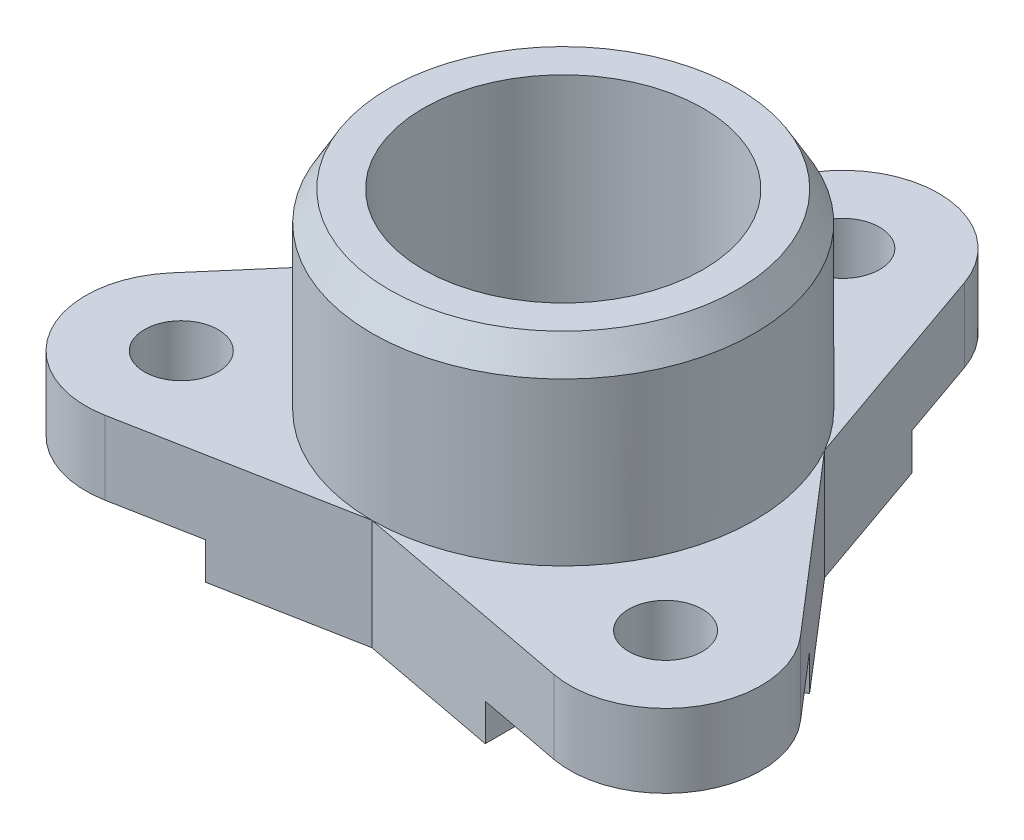
ISO-10303-21;
HEADER;
FILE_DESCRIPTION(('STEP AP214'),'2;1');
FILE_NAME('part.step','',(''),(''),'','','');
FILE_SCHEMA(('AUTOMOTIVE_DESIGN { 1 0 10303 214 1 1 1 1 }'));
ENDSEC;
DATA;
#1=APPLICATION_CONTEXT('core data for automotive mechanical design processes');
#2=APPLICATION_PROTOCOL_DEFINITION('international standard','automotive_design',2000,#1);
#3=PRODUCT_CONTEXT('',#1,'mechanical');
#4=PRODUCT('Part','Part','',(#3));
#5=PRODUCT_RELATED_PRODUCT_CATEGORY('part','',(#4));
#6=PRODUCT_DEFINITION_FORMATION('','',#4);
#7=PRODUCT_DEFINITION_CONTEXT('part definition',#1,'design');
#8=PRODUCT_DEFINITION('design','',#6,#7);
#9=PRODUCT_DEFINITION_SHAPE('','',#8);
#10=(LENGTH_UNIT() NAMED_UNIT(*) SI_UNIT(.MILLI.,.METRE.));
#11=(NAMED_UNIT(*) PLANE_ANGLE_UNIT() SI_UNIT($,.RADIAN.));
#12=(NAMED_UNIT(*) SI_UNIT($,.STERADIAN.) SOLID_ANGLE_UNIT());
#13=UNCERTAINTY_MEASURE_WITH_UNIT(LENGTH_MEASURE(1.E-05),#10,'distance_accuracy_value','');
#14=(GEOMETRIC_REPRESENTATION_CONTEXT(3) GLOBAL_UNCERTAINTY_ASSIGNED_CONTEXT((#13)) GLOBAL_UNIT_ASSIGNED_CONTEXT((#10,
#11,#12)) REPRESENTATION_CONTEXT('',''));
#15=CARTESIAN_POINT('',(0.,0.,0.));
#16=DIRECTION('',(0.,0.,1.));
#17=DIRECTION('',(1.,0.,0.));
#18=AXIS2_PLACEMENT_3D('',#15,#16,#17);
#19=CARTESIAN_POINT('',(0.,0.,0.));
#20=DIRECTION('',(0.,1.,0.));
#21=DIRECTION('',(0.,0.,1.));
#22=AXIS2_PLACEMENT_3D('',#19,#20,#21);
#23=PLANE('',#22);
#24=CARTESIAN_POINT('',(-8.22724133595217,0.,4.75));
#25=DIRECTION('',(0.,1.,0.));
#26=DIRECTION('',(0.,0.,1.));
#27=AXIS2_PLACEMENT_3D('',#24,#25,#26);
#28=CIRCLE('',#27,1.25);
#29=CARTESIAN_POINT('',(-8.22724133595217,0.,6.));
#30=VERTEX_POINT('',#29);
#31=EDGE_CURVE('E331',#30,#30,#28,.T.);
#32=ORIENTED_EDGE('',*,*,#31,.T.);
#33=EDGE_LOOP('',(#32));
#34=FACE_BOUND('',#33,.T.);
#35=CARTESIAN_POINT('',(0.,0.,-9.5));
#36=DIRECTION('',(0.,1.,0.));
#37=DIRECTION('',(0.,0.,1.));
#38=AXIS2_PLACEMENT_3D('',#35,#36,#37);
#39=CIRCLE('',#38,1.25);
#40=CARTESIAN_POINT('',(0.,0.,-8.25));
#41=VERTEX_POINT('',#40);
#42=EDGE_CURVE('E357',#41,#41,#39,.T.);
#43=ORIENTED_EDGE('',*,*,#42,.T.);
#44=EDGE_LOOP('',(#43));
#45=FACE_BOUND('',#44,.T.);
#46=CARTESIAN_POINT('',(0.,0.,0.));
#47=DIRECTION('',(0.,1.,0.));
#48=DIRECTION('',(0.,0.,1.));
#49=AXIS2_PLACEMENT_3D('',#46,#47,#48);
#50=CIRCLE('',#49,4.75);
#51=CARTESIAN_POINT('',(0.,0.,4.75));
#52=VERTEX_POINT('',#51);
#53=EDGE_CURVE('E302',#52,#52,#50,.T.);
#54=ORIENTED_EDGE('',*,*,#53,.T.);
#55=EDGE_LOOP('',(#54));
#56=FACE_BOUND('',#55,.T.);
#57=CARTESIAN_POINT('',(8.22724133595217,0.,4.75));
#58=DIRECTION('',(0.,1.,0.));
#59=DIRECTION('',(0.,0.,1.));
#60=AXIS2_PLACEMENT_3D('',#57,#58,#59);
#61=CIRCLE('',#60,1.25);
#62=CARTESIAN_POINT('',(8.22724133595217,0.,6.));
#63=VERTEX_POINT('',#62);
#64=EDGE_CURVE('E334',#63,#63,#61,.T.);
#65=ORIENTED_EDGE('',*,*,#64,.T.);
#66=EDGE_LOOP('',(#65));
#67=FACE_BOUND('',#66,.T.);
#68=DIRECTION('',(-0.499999999999992,0.,0.866025403784443));
#69=VECTOR('',#68,1.);
#70=CARTESIAN_POINT('',(-4.97964607176055,0.,-2.87499999999995));
#71=LINE('',#70,#69);
#72=CARTESIAN_POINT('',(-2.60464607176059,0.,-6.98862066797606));
#73=VERTEX_POINT('',#72);
#74=CARTESIAN_POINT('',(-7.35464607176051,0.,1.23862066797615));
#75=VERTEX_POINT('',#74);
#76=EDGE_CURVE('E213',#73,#75,#71,.T.);
#77=ORIENTED_EDGE('',*,*,#76,.F.);
#78=DIRECTION('',(-0.866025403784443,0.,-0.499999999999992));
#79=VECTOR('',#78,1.);
#80=CARTESIAN_POINT('',(2.37499999999996,0.,-4.1136206679761));
#81=LINE('',#80,#79);
#82=CARTESIAN_POINT('',(-4.03303634923954,0.,-7.81330217918636));
#83=VERTEX_POINT('',#82);
#84=EDGE_CURVE('E210',#73,#83,#81,.T.);
#85=ORIENTED_EDGE('',*,*,#84,.T.);
#86=DIRECTION('',(-0.330161167685148,0.,0.943924575033821));
#87=VECTOR('',#86,1.);
#88=CARTESIAN_POINT('',(-6.02840364790872,0.,-2.10858456312533));
#89=LINE('',#88,#87);
#90=CARTESIAN_POINT('',(-3.06775486885992,0.,-10.5730237949767));
#91=VERTEX_POINT('',#90);
#92=EDGE_CURVE('E348',#91,#83,#89,.T.);
#93=ORIENTED_EDGE('',*,*,#92,.F.);
#94=CARTESIAN_POINT('',(0.,0.,-9.5));
#95=DIRECTION('',(0.,1.,0.));
#96=DIRECTION('',(0.,0.,1.));
#97=AXIS2_PLACEMENT_3D('',#94,#95,#96);
#98=CIRCLE('',#97,3.25);
#99=CARTESIAN_POINT('',(3.06775486885992,0.,-10.5730237949767));
#100=VERTEX_POINT('',#99);
#101=EDGE_CURVE('E346',#100,#91,#98,.T.);
#102=ORIENTED_EDGE('',*,*,#101,.F.);
#103=DIRECTION('',(0.330161167685148,0.,0.943924575033821));
#104=VECTOR('',#103,1.);
#105=CARTESIAN_POINT('',(6.02840364790872,0.,-2.10858456312532));
#106=LINE('',#105,#104);
#107=CARTESIAN_POINT('',(4.03303634923946,0.,-7.81330217918642));
#108=VERTEX_POINT('',#107);
#109=EDGE_CURVE('E344',#100,#108,#106,.T.);
#110=ORIENTED_EDGE('',*,*,#109,.T.);
#111=DIRECTION('',(0.866025403784436,0.,-0.500000000000004));
#112=VECTOR('',#111,1.);
#113=CARTESIAN_POINT('',(-2.37500000000002,0.,-4.11362066797607));
#114=LINE('',#113,#112);
#115=CARTESIAN_POINT('',(2.60464607176049,0.,-6.9886206679761));
#116=VERTEX_POINT('',#115);
#117=EDGE_CURVE('E225',#116,#108,#114,.T.);
#118=ORIENTED_EDGE('',*,*,#117,.F.);
#119=DIRECTION('',(-0.500000000000004,0.,-0.866025403784436));
#120=VECTOR('',#119,1.);
#121=CARTESIAN_POINT('',(4.97964607176051,0.,-2.87500000000002));
#122=LINE('',#121,#120);
#123=CARTESIAN_POINT('',(7.35464607176053,0.,1.23862066797605));
#124=VERTEX_POINT('',#123);
#125=EDGE_CURVE('E63',#124,#116,#122,.T.);
#126=ORIENTED_EDGE('',*,*,#125,.F.);
#127=DIRECTION('',(0.866025403784436,0.,-0.500000000000004));
#128=VECTOR('',#127,1.);
#129=CARTESIAN_POINT('',(2.37500000000002,0.,4.11362066797607));
#130=LINE('',#129,#128);
#131=CARTESIAN_POINT('',(8.78303634923947,0.,0.413939156765781));
#132=VERTEX_POINT('',#131);
#133=EDGE_CURVE('E235',#124,#132,#130,.T.);
#134=ORIENTED_EDGE('',*,*,#133,.T.);
#135=DIRECTION('',(0.652382077393145,0.,0.757890246075383));
#136=VECTOR('',#135,1.);
#137=CARTESIAN_POINT('',(4.8402896216486,0.,-4.16645842179307));
#138=LINE('',#137,#136);
#139=CARTESIAN_POINT('',(10.6903846356972,0.,2.62975824847228));
#140=VERTEX_POINT('',#139);
#141=EDGE_CURVE('E342',#132,#140,#138,.T.);
#142=ORIENTED_EDGE('',*,*,#141,.T.);
#143=CARTESIAN_POINT('',(8.22724133595217,0.,4.75));
#144=DIRECTION('',(0.,1.,0.));
#145=DIRECTION('',(0.,0.,1.));
#146=AXIS2_PLACEMENT_3D('',#143,#144,#145);
#147=CIRCLE('',#146,3.25);
#148=CARTESIAN_POINT('',(7.62262976683724,0.,7.94326554650445));
#149=VERTEX_POINT('',#148);
#150=EDGE_CURVE('E339',#149,#140,#147,.T.);
#151=ORIENTED_EDGE('',*,*,#150,.F.);
#152=DIRECTION('',(0.982543245078293,0.,0.186034328958438));
#153=VECTOR('',#152,1.);
#154=CARTESIAN_POINT('',(-1.18811402626011,0.,6.27504298491839));
#155=LINE('',#154,#153);
#156=CARTESIAN_POINT('',(4.75,0.,7.39936302242063));
#157=VERTEX_POINT('',#156);
#158=EDGE_CURVE('E337',#157,#149,#155,.T.);
#159=ORIENTED_EDGE('',*,*,#158,.F.);
#160=DIRECTION('',(0.,0.,1.));
#161=VECTOR('',#160,1.);
#162=CARTESIAN_POINT('',(4.75,0.,0.));
#163=LINE('',#162,#161);
#164=CARTESIAN_POINT('',(4.75,0.,5.75));
#165=VERTEX_POINT('',#164);
#166=EDGE_CURVE('E253',#165,#157,#163,.T.);
#167=ORIENTED_EDGE('',*,*,#166,.F.);
#168=DIRECTION('',(1.,0.,0.));
#169=VECTOR('',#168,1.);
#170=CARTESIAN_POINT('',(0.,0.,5.75));
#171=LINE('',#170,#169);
#172=CARTESIAN_POINT('',(-4.75,0.,5.75));
#173=VERTEX_POINT('',#172);
#174=EDGE_CURVE('E278',#173,#165,#171,.T.);
#175=ORIENTED_EDGE('',*,*,#174,.F.);
#176=DIRECTION('',(0.,0.,1.));
#177=VECTOR('',#176,1.);
#178=CARTESIAN_POINT('',(-4.75,0.,0.));
#179=LINE('',#178,#177);
#180=CARTESIAN_POINT('',(-4.75,0.,7.39936302242063));
#181=VERTEX_POINT('',#180);
#182=EDGE_CURVE('E265',#173,#181,#179,.T.);
#183=ORIENTED_EDGE('',*,*,#182,.T.);
#184=DIRECTION('',(0.982543245078294,0.,-0.186034328958438));
#185=VECTOR('',#184,1.);
#186=CARTESIAN_POINT('',(1.18811402626011,0.,6.2750429849184));
#187=LINE('',#186,#185);
#188=CARTESIAN_POINT('',(-7.62262976683724,0.,7.94326554650445));
#189=VERTEX_POINT('',#188);
#190=EDGE_CURVE('E354',#189,#181,#187,.T.);
#191=ORIENTED_EDGE('',*,*,#190,.F.);
#192=CARTESIAN_POINT('',(-8.22724133595217,0.,4.75));
#193=DIRECTION('',(0.,1.,0.));
#194=DIRECTION('',(0.,0.,1.));
#195=AXIS2_PLACEMENT_3D('',#192,#193,#194);
#196=CIRCLE('',#195,3.25);
#197=CARTESIAN_POINT('',(-10.6903846356972,0.,2.62975824847228));
#198=VERTEX_POINT('',#197);
#199=EDGE_CURVE('E352',#198,#189,#196,.T.);
#200=ORIENTED_EDGE('',*,*,#199,.F.);
#201=DIRECTION('',(-0.652382077393145,0.,0.757890246075383));
#202=VECTOR('',#201,1.);
#203=CARTESIAN_POINT('',(-4.8402896216486,0.,-4.16645842179307));
#204=LINE('',#203,#202);
#205=CARTESIAN_POINT('',(-8.78303634923946,0.,0.413939156765772));
#206=VERTEX_POINT('',#205);
#207=EDGE_CURVE('E350',#206,#198,#204,.T.);
#208=ORIENTED_EDGE('',*,*,#207,.F.);
#209=DIRECTION('',(-0.866025403784443,0.,-0.499999999999992));
#210=VECTOR('',#209,1.);
#211=CARTESIAN_POINT('',(-2.37499999999996,0.,4.1136206679761));
#212=LINE('',#211,#210);
#213=EDGE_CURVE('E55',#75,#206,#212,.T.);
#214=ORIENTED_EDGE('',*,*,#213,.F.);
#215=EDGE_LOOP('',(#77,#85,#93,#102,#110,#118,#126,#134,#142,#151,#159,#167,#175,#183,#191,#200,
#208,#214));
#216=FACE_BOUND('',#215,.T.);
#217=ADVANCED_FACE('F39',(#34,#45,#56,#67,#216),#23,.F.);
#218=CARTESIAN_POINT('',(0.,2.5,0.));
#219=DIRECTION('',(0.,1.,0.));
#220=DIRECTION('',(0.,0.,1.));
#221=AXIS2_PLACEMENT_3D('',#218,#219,#220);
#222=PLANE('',#221);
#223=CARTESIAN_POINT('',(-8.22724133595217,2.5,4.75));
#224=DIRECTION('',(0.,1.,0.));
#225=DIRECTION('',(0.,0.,1.));
#226=AXIS2_PLACEMENT_3D('',#223,#224,#225);
#227=CIRCLE('',#226,1.25);
#228=CARTESIAN_POINT('',(-8.22724133595217,2.5,6.));
#229=VERTEX_POINT('',#228);
#230=EDGE_CURVE('E298',#229,#229,#227,.T.);
#231=ORIENTED_EDGE('',*,*,#230,.F.);
#232=EDGE_LOOP('',(#231));
#233=FACE_BOUND('',#232,.T.);
#234=DIRECTION('',(0.982543245078294,0.,-0.186034328958438));
#235=VECTOR('',#234,1.);
#236=CARTESIAN_POINT('',(1.18811402626011,2.5,6.2750429849184));
#237=LINE('',#236,#235);
#238=CARTESIAN_POINT('',(-7.62262976683724,2.5,7.94326554650445));
#239=VERTEX_POINT('',#238);
#240=CARTESIAN_POINT('',(0.,2.5,6.5));
#241=VERTEX_POINT('',#240);
#242=EDGE_CURVE('E324',#239,#241,#237,.T.);
#243=ORIENTED_EDGE('',*,*,#242,.T.);
#244=CARTESIAN_POINT('',(0.,2.5,0.));
#245=DIRECTION('',(0.,1.,0.));
#246=DIRECTION('',(0.,0.,1.));
#247=AXIS2_PLACEMENT_3D('',#244,#245,#246);
#248=CIRCLE('',#247,6.5);
#249=CARTESIAN_POINT('',(-5.62916512459885,2.5,-3.25000000000001));
#250=VERTEX_POINT('',#249);
#251=EDGE_CURVE('E297',#241,#250,#248,.F.);
#252=ORIENTED_EDGE('',*,*,#251,.T.);
#253=DIRECTION('',(-0.652382077393145,0.,0.757890246075383));
#254=VECTOR('',#253,1.);
#255=CARTESIAN_POINT('',(-4.8402896216486,2.5,-4.16645842179307));
#256=LINE('',#255,#254);
#257=CARTESIAN_POINT('',(-10.6903846356972,2.5,2.62975824847228));
#258=VERTEX_POINT('',#257);
#259=EDGE_CURVE('E191',#250,#258,#256,.T.);
#260=ORIENTED_EDGE('',*,*,#259,.T.);
#261=CARTESIAN_POINT('',(-8.22724133595217,2.5,4.75));
#262=DIRECTION('',(0.,1.,0.));
#263=DIRECTION('',(0.,0.,1.));
#264=AXIS2_PLACEMENT_3D('',#261,#262,#263);
#265=CIRCLE('',#264,3.25);
#266=EDGE_CURVE('E322',#258,#239,#265,.T.);
#267=ORIENTED_EDGE('',*,*,#266,.T.);
#268=EDGE_LOOP('',(#243,#252,#260,#267));
#269=FACE_BOUND('',#268,.T.);
#270=ADVANCED_FACE('F399',(#233,#269),#222,.T.);
#271=CARTESIAN_POINT('',(0.,2.5,-9.5));
#272=DIRECTION('',(0.,1.,0.));
#273=DIRECTION('',(0.,0.,1.));
#274=AXIS2_PLACEMENT_3D('',#271,#272,#273);
#275=CIRCLE('',#274,1.25);
#276=CARTESIAN_POINT('',(0.,2.5,-8.25));
#277=VERTEX_POINT('',#276);
#278=EDGE_CURVE('E327',#277,#277,#275,.T.);
#279=ORIENTED_EDGE('',*,*,#278,.F.);
#280=EDGE_LOOP('',(#279));
#281=FACE_BOUND('',#280,.T.);
#282=DIRECTION('',(-0.330161167685148,0.,0.943924575033821));
#283=VECTOR('',#282,1.);
#284=CARTESIAN_POINT('',(-6.02840364790872,2.5,-2.10858456312533));
#285=LINE('',#284,#283);
#286=CARTESIAN_POINT('',(-3.06775486885992,2.5,-10.5730237949767));
#287=VERTEX_POINT('',#286);
#288=EDGE_CURVE('E318',#287,#250,#285,.T.);
#289=ORIENTED_EDGE('',*,*,#288,.T.);
#290=CARTESIAN_POINT('',(5.62916512459885,2.5,-3.25000000000001));
#291=VERTEX_POINT('',#290);
#292=EDGE_CURVE('E296',#250,#291,#248,.F.);
#293=ORIENTED_EDGE('',*,*,#292,.T.);
#294=DIRECTION('',(0.330161167685148,0.,0.943924575033821));
#295=VECTOR('',#294,1.);
#296=CARTESIAN_POINT('',(6.02840364790872,2.5,-2.10858456312532));
#297=LINE('',#296,#295);
#298=CARTESIAN_POINT('',(3.06775486885992,2.5,-10.5730237949767));
#299=VERTEX_POINT('',#298);
#300=EDGE_CURVE('E313',#299,#291,#297,.T.);
#301=ORIENTED_EDGE('',*,*,#300,.F.);
#302=CARTESIAN_POINT('',(0.,2.5,-9.5));
#303=DIRECTION('',(0.,1.,0.));
#304=DIRECTION('',(0.,0.,1.));
#305=AXIS2_PLACEMENT_3D('',#302,#303,#304);
#306=CIRCLE('',#305,3.25);
#307=EDGE_CURVE('E316',#299,#287,#306,.T.);
#308=ORIENTED_EDGE('',*,*,#307,.T.);
#309=EDGE_LOOP('',(#289,#293,#301,#308));
#310=FACE_BOUND('',#309,.T.);
#311=ADVANCED_FACE('F405',(#281,#310),#222,.T.);
#312=CARTESIAN_POINT('',(-1.18811402626011,2.5,6.27504298491839));
#313=DIRECTION('',(0.186034328958438,0.,-0.982543245078294));
#314=DIRECTION('',(-0.982543245078294,0.,-0.186034328958438));
#315=AXIS2_PLACEMENT_3D('',#312,#313,#314);
#316=PLANE('',#315);
#317=DIRECTION('',(0.,-1.,0.));
#318=VECTOR('',#317,1.);
#319=CARTESIAN_POINT('',(0.,2.5,6.5));
#320=LINE('',#319,#318);
#321=CARTESIAN_POINT('',(0.,-1.25,6.5));
#322=VERTEX_POINT('',#321);
#323=EDGE_CURVE('E330',#241,#322,#320,.T.);
#324=ORIENTED_EDGE('',*,*,#323,.T.);
#325=DIRECTION('',(0.982543245078293,0.,0.186034328958438));
#326=VECTOR('',#325,1.);
#327=CARTESIAN_POINT('',(-1.18811402626011,-1.25,6.27504298491839));
#328=LINE('',#327,#326);
#329=CARTESIAN_POINT('',(4.75,-1.25,7.39936302242063));
#330=VERTEX_POINT('',#329);
#331=EDGE_CURVE('E264',#322,#330,#328,.T.);
#332=ORIENTED_EDGE('',*,*,#331,.T.);
#333=DIRECTION('',(0.,1.,0.));
#334=VECTOR('',#333,1.);
#335=CARTESIAN_POINT('',(4.75,-1.25,7.39936302242063));
#336=LINE('',#335,#334);
#337=EDGE_CURVE('E275',#330,#157,#336,.T.);
#338=ORIENTED_EDGE('',*,*,#337,.T.);
#339=ORIENTED_EDGE('',*,*,#158,.T.);
#340=DIRECTION('',(0.,-1.,0.));
#341=VECTOR('',#340,1.);
#342=CARTESIAN_POINT('',(7.62262976683724,2.5,7.94326554650445));
#343=LINE('',#342,#341);
#344=CARTESIAN_POINT('',(7.62262976683724,2.5,7.94326554650445));
#345=VERTEX_POINT('',#344);
#346=EDGE_CURVE('E377',#345,#149,#343,.T.);
#347=ORIENTED_EDGE('',*,*,#346,.F.);
#348=DIRECTION('',(0.982543245078293,0.,0.186034328958438));
#349=VECTOR('',#348,1.);
#350=CARTESIAN_POINT('',(-1.18811402626011,2.5,6.27504298491839));
#351=LINE('',#350,#349);
#352=EDGE_CURVE('E305',#241,#345,#351,.T.);
#353=ORIENTED_EDGE('',*,*,#352,.F.);
#354=EDGE_LOOP('',(#324,#332,#338,#339,#347,#353));
#355=FACE_BOUND('',#354,.T.);
#356=ADVANCED_FACE('F449',(#355),#316,.F.);
#357=CARTESIAN_POINT('',(8.22724133595217,2.5,4.75));
#358=DIRECTION('',(0.,-1.,0.));
#359=DIRECTION('',(0.,0.,-1.));
#360=AXIS2_PLACEMENT_3D('',#357,#358,#359);
#361=CYLINDRICAL_SURFACE('',#360,3.25);
#362=ORIENTED_EDGE('',*,*,#150,.T.);
#363=DIRECTION('',(0.,-1.,0.));
#364=VECTOR('',#363,1.);
#365=CARTESIAN_POINT('',(10.6903846356972,2.5,2.62975824847228));
#366=LINE('',#365,#364);
#367=CARTESIAN_POINT('',(10.6903846356972,2.5,2.62975824847228));
#368=VERTEX_POINT('',#367);
#369=EDGE_CURVE('E374',#368,#140,#366,.T.);
#370=ORIENTED_EDGE('',*,*,#369,.F.);
#371=CARTESIAN_POINT('',(8.22724133595217,2.5,4.75));
#372=DIRECTION('',(0.,1.,0.));
#373=DIRECTION('',(0.,0.,1.));
#374=AXIS2_PLACEMENT_3D('',#371,#372,#373);
#375=CIRCLE('',#374,3.25);
#376=EDGE_CURVE('E308',#345,#368,#375,.T.);
#377=ORIENTED_EDGE('',*,*,#376,.F.);
#378=ORIENTED_EDGE('',*,*,#346,.T.);
#379=EDGE_LOOP('',(#362,#370,#377,#378));
#380=FACE_BOUND('',#379,.T.);
#381=ADVANCED_FACE('F445',(#380),#361,.T.);
#382=CARTESIAN_POINT('',(4.8402896216486,2.5,-4.16645842179307));
#383=DIRECTION('',(0.757890246075383,0.,-0.652382077393145));
#384=DIRECTION('',(-0.652382077393145,0.,-0.757890246075383));
#385=AXIS2_PLACEMENT_3D('',#382,#383,#384);
#386=PLANE('',#385);
#387=ORIENTED_EDGE('',*,*,#141,.F.);
#388=DIRECTION('',(0.,1.,0.));
#389=VECTOR('',#388,1.);
#390=CARTESIAN_POINT('',(8.78303634923947,-1.25,0.413939156765729));
#391=LINE('',#390,#389);
#392=CARTESIAN_POINT('',(8.78303634923947,-1.25,0.413939156765729));
#393=VERTEX_POINT('',#392);
#394=EDGE_CURVE('E250',#393,#132,#391,.T.);
#395=ORIENTED_EDGE('',*,*,#394,.F.);
#396=DIRECTION('',(-0.652382077393149,0.,-0.75789024607538));
#397=VECTOR('',#396,1.);
#398=CARTESIAN_POINT('',(4.84028962164859,-1.25,-4.16645842179309));
#399=LINE('',#398,#397);
#400=CARTESIAN_POINT('',(5.62916512459884,-1.25,-3.25000000000003));
#401=VERTEX_POINT('',#400);
#402=EDGE_CURVE('E231',#393,#401,#399,.T.);
#403=ORIENTED_EDGE('',*,*,#402,.T.);
#404=DIRECTION('',(0.,-1.,0.));
#405=VECTOR('',#404,1.);
#406=CARTESIAN_POINT('',(5.62916512459885,2.5,-3.25));
#407=LINE('',#406,#405);
#408=EDGE_CURVE('E372',#291,#401,#407,.T.);
#409=ORIENTED_EDGE('',*,*,#408,.F.);
#410=DIRECTION('',(0.652382077393145,0.,0.757890246075383));
#411=VECTOR('',#410,1.);
#412=CARTESIAN_POINT('',(4.8402896216486,2.5,-4.16645842179307));
#413=LINE('',#412,#411);
#414=EDGE_CURVE('E310',#291,#368,#413,.T.);
#415=ORIENTED_EDGE('',*,*,#414,.T.);
#416=ORIENTED_EDGE('',*,*,#369,.T.);
#417=EDGE_LOOP('',(#387,#395,#403,#409,#415,#416));
#418=FACE_BOUND('',#417,.T.);
#419=ADVANCED_FACE('F441',(#418),#386,.T.);
#420=CARTESIAN_POINT('',(6.02840364790872,2.5,-2.10858456312532));
#421=DIRECTION('',(0.943924575033821,0.,-0.330161167685148));
#422=DIRECTION('',(-0.330161167685148,0.,-0.943924575033821));
#423=AXIS2_PLACEMENT_3D('',#420,#421,#422);
#424=PLANE('',#423);
#425=ORIENTED_EDGE('',*,*,#109,.F.);
#426=DIRECTION('',(0.,-1.,0.));
#427=VECTOR('',#426,1.);
#428=CARTESIAN_POINT('',(3.06775486885992,2.5,-10.5730237949767));
#429=LINE('',#428,#427);
#430=EDGE_CURVE('E370',#299,#100,#429,.T.);
#431=ORIENTED_EDGE('',*,*,#430,.F.);
#432=ORIENTED_EDGE('',*,*,#300,.T.);
#433=ORIENTED_EDGE('',*,*,#408,.T.);
#434=DIRECTION('',(-0.330161167685153,0.,-0.94392457503382));
#435=VECTOR('',#434,1.);
#436=CARTESIAN_POINT('',(6.02840364790871,-1.25,-2.10858456312535));
#437=LINE('',#436,#435);
#438=CARTESIAN_POINT('',(4.03303634923943,-1.25,-7.81330217918642));
#439=VERTEX_POINT('',#438);
#440=EDGE_CURVE('E234',#401,#439,#437,.T.);
#441=ORIENTED_EDGE('',*,*,#440,.T.);
#442=DIRECTION('',(0.,1.,0.));
#443=VECTOR('',#442,1.);
#444=CARTESIAN_POINT('',(4.03303634923943,-1.25,-7.81330217918642));
#445=LINE('',#444,#443);
#446=EDGE_CURVE('E245',#439,#108,#445,.T.);
#447=ORIENTED_EDGE('',*,*,#446,.T.);
#448=EDGE_LOOP('',(#425,#431,#432,#433,#441,#447));
#449=FACE_BOUND('',#448,.T.);
#450=ADVANCED_FACE('F437',(#449),#424,.T.);
#451=CARTESIAN_POINT('',(0.,2.5,-9.5));
#452=DIRECTION('',(0.,-1.,0.));
#453=DIRECTION('',(0.,0.,-1.));
#454=AXIS2_PLACEMENT_3D('',#451,#452,#453);
#455=CYLINDRICAL_SURFACE('',#454,3.25);
#456=ORIENTED_EDGE('',*,*,#101,.T.);
#457=DIRECTION('',(0.,-1.,0.));
#458=VECTOR('',#457,1.);
#459=CARTESIAN_POINT('',(-3.06775486885992,2.5,-10.5730237949767));
#460=LINE('',#459,#458);
#461=EDGE_CURVE('E195',#287,#91,#460,.T.);
#462=ORIENTED_EDGE('',*,*,#461,.F.);
#463=ORIENTED_EDGE('',*,*,#307,.F.);
#464=ORIENTED_EDGE('',*,*,#430,.T.);
#465=EDGE_LOOP('',(#456,#462,#463,#464));
#466=FACE_BOUND('',#465,.T.);
#467=ADVANCED_FACE('F434',(#466),#455,.T.);
#468=CARTESIAN_POINT('',(-6.02840364790872,2.5,-2.10858456312533));
#469=DIRECTION('',(0.943924575033821,0.,0.330161167685148));
#470=DIRECTION('',(0.330161167685148,0.,-0.943924575033821));
#471=AXIS2_PLACEMENT_3D('',#468,#469,#470);
#472=PLANE('',#471);
#473=ORIENTED_EDGE('',*,*,#92,.T.);
#474=DIRECTION('',(0.,1.,0.));
#475=VECTOR('',#474,1.);
#476=CARTESIAN_POINT('',(-4.03303634923954,-1.25,-7.81330217918636));
#477=LINE('',#476,#475);
#478=CARTESIAN_POINT('',(-4.03303634923954,-1.25,-7.81330217918636));
#479=VERTEX_POINT('',#478);
#480=EDGE_CURVE('E209',#479,#83,#477,.T.);
#481=ORIENTED_EDGE('',*,*,#480,.F.);
#482=DIRECTION('',(-0.33016116768514,0.,0.943924575033824));
#483=VECTOR('',#482,1.);
#484=CARTESIAN_POINT('',(-6.02840364790874,-1.25,-2.10858456312527));
#485=LINE('',#484,#483);
#486=CARTESIAN_POINT('',(-5.62916512459888,-1.25,-3.24999999999995));
#487=VERTEX_POINT('',#486);
#488=EDGE_CURVE('E202',#479,#487,#485,.T.);
#489=ORIENTED_EDGE('',*,*,#488,.T.);
#490=DIRECTION('',(0.,-1.,0.));
#491=VECTOR('',#490,1.);
#492=CARTESIAN_POINT('',(-5.62916512459885,2.5,-3.25));
#493=LINE('',#492,#491);
#494=EDGE_CURVE('E186',#250,#487,#493,.T.);
#495=ORIENTED_EDGE('',*,*,#494,.F.);
#496=ORIENTED_EDGE('',*,*,#288,.F.);
#497=ORIENTED_EDGE('',*,*,#461,.T.);
#498=EDGE_LOOP('',(#473,#481,#489,#495,#496,#497));
#499=FACE_BOUND('',#498,.T.);
#500=ADVANCED_FACE('F208',(#499),#472,.F.);
#501=CARTESIAN_POINT('',(-4.8402896216486,2.5,-4.16645842179307));
#502=DIRECTION('',(0.757890246075383,0.,0.652382077393145));
#503=DIRECTION('',(0.652382077393145,0.,-0.757890246075383));
#504=AXIS2_PLACEMENT_3D('',#501,#502,#503);
#505=PLANE('',#504);
#506=ORIENTED_EDGE('',*,*,#494,.T.);
#507=DIRECTION('',(-0.652382077393138,0.,0.757890246075389));
#508=VECTOR('',#507,1.);
#509=CARTESIAN_POINT('',(-4.84028962164864,-1.25,-4.16645842179302));
#510=LINE('',#509,#508);
#511=CARTESIAN_POINT('',(-8.78303634923946,-1.25,0.413939156765853));
#512=VERTEX_POINT('',#511);
#513=EDGE_CURVE('E189',#487,#512,#510,.T.);
#514=ORIENTED_EDGE('',*,*,#513,.T.);
#515=DIRECTION('',(0.,1.,0.));
#516=VECTOR('',#515,1.);
#517=CARTESIAN_POINT('',(-8.78303634923946,-1.25,0.413939156765853));
#518=LINE('',#517,#516);
#519=EDGE_CURVE('E221',#512,#206,#518,.T.);
#520=ORIENTED_EDGE('',*,*,#519,.T.);
#521=ORIENTED_EDGE('',*,*,#207,.T.);
#522=DIRECTION('',(0.,-1.,0.));
#523=VECTOR('',#522,1.);
#524=CARTESIAN_POINT('',(-10.6903846356972,2.5,2.62975824847228));
#525=LINE('',#524,#523);
#526=EDGE_CURVE('E196',#258,#198,#525,.T.);
#527=ORIENTED_EDGE('',*,*,#526,.F.);
#528=ORIENTED_EDGE('',*,*,#259,.F.);
#529=EDGE_LOOP('',(#506,#514,#520,#521,#527,#528));
#530=FACE_BOUND('',#529,.T.);
#531=ADVANCED_FACE('F188',(#530),#505,.F.);
#532=CARTESIAN_POINT('',(-8.22724133595217,2.5,4.75));
#533=DIRECTION('',(0.,-1.,0.));
#534=DIRECTION('',(0.,0.,-1.));
#535=AXIS2_PLACEMENT_3D('',#532,#533,#534);
#536=CYLINDRICAL_SURFACE('',#535,3.25);
#537=ORIENTED_EDGE('',*,*,#199,.T.);
#538=DIRECTION('',(0.,-1.,0.));
#539=VECTOR('',#538,1.);
#540=CARTESIAN_POINT('',(-7.62262976683724,2.5,7.94326554650445));
#541=LINE('',#540,#539);
#542=EDGE_CURVE('E363',#239,#189,#541,.T.);
#543=ORIENTED_EDGE('',*,*,#542,.F.);
#544=ORIENTED_EDGE('',*,*,#266,.F.);
#545=ORIENTED_EDGE('',*,*,#526,.T.);
#546=EDGE_LOOP('',(#537,#543,#544,#545));
#547=FACE_BOUND('',#546,.T.);
#548=ADVANCED_FACE('F421',(#547),#536,.T.);
#549=CARTESIAN_POINT('',(0.,2.5,-9.5));
#550=DIRECTION('',(0.,-1.,0.));
#551=DIRECTION('',(0.,0.,-1.));
#552=AXIS2_PLACEMENT_3D('',#549,#550,#551);
#553=CYLINDRICAL_SURFACE('',#552,1.25);
#554=ORIENTED_EDGE('',*,*,#278,.T.);
#555=EDGE_LOOP('',(#554));
#556=FACE_BOUND('',#555,.T.);
#557=ORIENTED_EDGE('',*,*,#42,.F.);
#558=EDGE_LOOP('',(#557));
#559=FACE_BOUND('',#558,.T.);
#560=ADVANCED_FACE('F417',(#556,#559),#553,.F.);
#561=CARTESIAN_POINT('',(1.18811402626011,2.5,6.2750429849184));
#562=DIRECTION('',(-0.186034328958438,0.,-0.982543245078294));
#563=DIRECTION('',(-0.982543245078294,0.,0.186034328958438));
#564=AXIS2_PLACEMENT_3D('',#561,#562,#563);
#565=PLANE('',#564);
#566=ORIENTED_EDGE('',*,*,#190,.T.);
#567=DIRECTION('',(0.,1.,0.));
#568=VECTOR('',#567,1.);
#569=CARTESIAN_POINT('',(-4.75,-1.25,7.39936302242063));
#570=LINE('',#569,#568);
#571=CARTESIAN_POINT('',(-4.75,-1.25,7.39936302242063));
#572=VERTEX_POINT('',#571);
#573=EDGE_CURVE('E282',#572,#181,#570,.T.);
#574=ORIENTED_EDGE('',*,*,#573,.F.);
#575=DIRECTION('',(0.982543245078294,0.,-0.186034328958438));
#576=VECTOR('',#575,1.);
#577=CARTESIAN_POINT('',(1.18811402626011,-1.25,6.2750429849184));
#578=LINE('',#577,#576);
#579=EDGE_CURVE('E261',#572,#322,#578,.T.);
#580=ORIENTED_EDGE('',*,*,#579,.T.);
#581=ORIENTED_EDGE('',*,*,#323,.F.);
#582=ORIENTED_EDGE('',*,*,#242,.F.);
#583=ORIENTED_EDGE('',*,*,#542,.T.);
#584=EDGE_LOOP('',(#566,#574,#580,#581,#582,#583));
#585=FACE_BOUND('',#584,.T.);
#586=ADVANCED_FACE('F420',(#585),#565,.F.);
#587=CARTESIAN_POINT('',(8.22724133595217,2.5,4.75));
#588=DIRECTION('',(0.,-1.,0.));
#589=DIRECTION('',(0.,0.,-1.));
#590=AXIS2_PLACEMENT_3D('',#587,#588,#589);
#591=CYLINDRICAL_SURFACE('',#590,1.25);
#592=CARTESIAN_POINT('',(8.22724133595217,2.5,4.75));
#593=DIRECTION('',(0.,1.,0.));
#594=DIRECTION('',(0.,0.,1.));
#595=AXIS2_PLACEMENT_3D('',#592,#593,#594);
#596=CIRCLE('',#595,1.25);
#597=CARTESIAN_POINT('',(8.22724133595217,2.5,6.));
#598=VERTEX_POINT('',#597);
#599=EDGE_CURVE('E301',#598,#598,#596,.T.);
#600=ORIENTED_EDGE('',*,*,#599,.T.);
#601=EDGE_LOOP('',(#600));
#602=FACE_BOUND('',#601,.T.);
#603=ORIENTED_EDGE('',*,*,#64,.F.);
#604=EDGE_LOOP('',(#603));
#605=FACE_BOUND('',#604,.T.);
#606=ADVANCED_FACE('F425',(#602,#605),#591,.F.);
#607=CARTESIAN_POINT('',(-8.22724133595217,2.5,4.75));
#608=DIRECTION('',(0.,-1.,0.));
#609=DIRECTION('',(0.,0.,-1.));
#610=AXIS2_PLACEMENT_3D('',#607,#608,#609);
#611=CYLINDRICAL_SURFACE('',#610,1.25);
#612=ORIENTED_EDGE('',*,*,#230,.T.);
#613=EDGE_LOOP('',(#612));
#614=FACE_BOUND('',#613,.T.);
#615=ORIENTED_EDGE('',*,*,#31,.F.);
#616=EDGE_LOOP('',(#615));
#617=FACE_BOUND('',#616,.T.);
#618=ADVANCED_FACE('F415',(#614,#617),#611,.F.);
#619=CARTESIAN_POINT('',(0.,2.5,0.));
#620=DIRECTION('',(0.,-1.,0.));
#621=DIRECTION('',(0.,0.,-1.));
#622=AXIS2_PLACEMENT_3D('',#619,#620,#621);
#623=CYLINDRICAL_SURFACE('',#622,4.75);
#624=ORIENTED_EDGE('',*,*,#53,.F.);
#625=EDGE_LOOP('',(#624));
#626=FACE_BOUND('',#625,.T.);
#627=CARTESIAN_POINT('',(0.,9.,0.));
#628=DIRECTION('',(0.,1.,0.));
#629=DIRECTION('',(0.,0.,1.));
#630=AXIS2_PLACEMENT_3D('',#627,#628,#629);
#631=CIRCLE('',#630,4.75);
#632=CARTESIAN_POINT('',(0.,9.,4.75));
#633=VERTEX_POINT('',#632);
#634=EDGE_CURVE('E284',#633,#633,#631,.T.);
#635=ORIENTED_EDGE('',*,*,#634,.T.);
#636=EDGE_LOOP('',(#635));
#637=FACE_BOUND('',#636,.T.);
#638=ADVANCED_FACE('F412',(#626,#637),#623,.F.);
#639=ORIENTED_EDGE('',*,*,#599,.F.);
#640=EDGE_LOOP('',(#639));
#641=FACE_BOUND('',#640,.T.);
#642=ORIENTED_EDGE('',*,*,#414,.F.);
#643=EDGE_CURVE('E293',#291,#241,#248,.F.);
#644=ORIENTED_EDGE('',*,*,#643,.T.);
#645=ORIENTED_EDGE('',*,*,#352,.T.);
#646=ORIENTED_EDGE('',*,*,#376,.T.);
#647=EDGE_LOOP('',(#642,#644,#645,#646));
#648=FACE_BOUND('',#647,.T.);
#649=ADVANCED_FACE('F408',(#641,#648),#222,.T.);
#650=CARTESIAN_POINT('',(0.,9.,0.));
#651=DIRECTION('',(0.,-1.,0.));
#652=DIRECTION('',(0.,0.,-1.));
#653=AXIS2_PLACEMENT_3D('',#650,#651,#652);
#654=CYLINDRICAL_SURFACE('',#653,6.5);
#655=CARTESIAN_POINT('',(0.,7.99999999999999,0.));
#656=DIRECTION('',(0.,1.,0.));
#657=DIRECTION('',(0.,0.,1.));
#658=AXIS2_PLACEMENT_3D('',#655,#656,#657);
#659=CIRCLE('',#658,6.5);
#660=CARTESIAN_POINT('',(0.,7.99999999999999,6.5));
#661=VERTEX_POINT('',#660);
#662=EDGE_CURVE('E11',#661,#661,#659,.F.);
#663=ORIENTED_EDGE('',*,*,#662,.T.);
#664=EDGE_LOOP('',(#663));
#665=FACE_BOUND('',#664,.T.);
#666=ORIENTED_EDGE('',*,*,#251,.F.);
#667=ORIENTED_EDGE('',*,*,#643,.F.);
#668=ORIENTED_EDGE('',*,*,#292,.F.);
#669=EDGE_LOOP('',(#666,#667,#668));
#670=FACE_BOUND('',#669,.T.);
#671=ADVANCED_FACE('F395',(#665,#670),#654,.T.);
#672=CARTESIAN_POINT('',(0.,9.,0.));
#673=DIRECTION('',(0.,1.,0.));
#674=DIRECTION('',(0.,0.,1.));
#675=AXIS2_PLACEMENT_3D('',#672,#673,#674);
#676=PLANE('',#675);
#677=CARTESIAN_POINT('',(0.,9.,0.));
#678=DIRECTION('',(0.,1.,0.));
#679=DIRECTION('',(0.,0.,1.));
#680=AXIS2_PLACEMENT_3D('',#677,#678,#679);
#681=CIRCLE('',#680,5.92264973081037);
#682=CARTESIAN_POINT('',(0.,9.,5.92264973081037));
#683=VERTEX_POINT('',#682);
#684=EDGE_CURVE('E48',#683,#683,#681,.T.);
#685=ORIENTED_EDGE('',*,*,#684,.T.);
#686=EDGE_LOOP('',(#685));
#687=FACE_BOUND('',#686,.T.);
#688=ORIENTED_EDGE('',*,*,#634,.F.);
#689=EDGE_LOOP('',(#688));
#690=FACE_BOUND('',#689,.T.);
#691=ADVANCED_FACE('F382',(#687,#690),#676,.T.);
#692=CARTESIAN_POINT('',(0.,9.,0.));
#693=DIRECTION('',(0.,-1.,0.));
#694=DIRECTION('',(0.,0.,-1.));
#695=AXIS2_PLACEMENT_3D('',#692,#693,#694);
#696=CONICAL_SURFACE('',#695,5.92264973081037,0.523598775598296);
#697=ORIENTED_EDGE('',*,*,#662,.F.);
#698=EDGE_LOOP('',(#697));
#699=FACE_BOUND('',#698,.T.);
#700=ORIENTED_EDGE('',*,*,#684,.F.);
#701=EDGE_LOOP('',(#700));
#702=FACE_BOUND('',#701,.T.);
#703=ADVANCED_FACE('F42',(#699,#702),#696,.T.);
#704=CARTESIAN_POINT('',(-4.75,-1.25,0.));
#705=DIRECTION('',(-1.,0.,0.));
#706=DIRECTION('',(0.,0.,1.));
#707=AXIS2_PLACEMENT_3D('',#704,#705,#706);
#708=PLANE('',#707);
#709=ORIENTED_EDGE('',*,*,#182,.F.);
#710=DIRECTION('',(0.,1.,0.));
#711=VECTOR('',#710,1.);
#712=CARTESIAN_POINT('',(-4.75,-1.25,5.75));
#713=LINE('',#712,#711);
#714=CARTESIAN_POINT('',(-4.75,-1.25,5.75));
#715=VERTEX_POINT('',#714);
#716=EDGE_CURVE('E285',#715,#173,#713,.T.);
#717=ORIENTED_EDGE('',*,*,#716,.F.);
#718=DIRECTION('',(0.,0.,1.));
#719=VECTOR('',#718,1.);
#720=CARTESIAN_POINT('',(-4.75,-1.25,0.));
#721=LINE('',#720,#719);
#722=EDGE_CURVE('E272',#715,#572,#721,.T.);
#723=ORIENTED_EDGE('',*,*,#722,.T.);
#724=ORIENTED_EDGE('',*,*,#573,.T.);
#725=EDGE_LOOP('',(#709,#717,#723,#724));
#726=FACE_BOUND('',#725,.T.);
#727=ADVANCED_FACE('F386',(#726),#708,.T.);
#728=CARTESIAN_POINT('',(0.,-1.25,5.75));
#729=DIRECTION('',(0.,0.,1.));
#730=DIRECTION('',(1.,0.,0.));
#731=AXIS2_PLACEMENT_3D('',#728,#729,#730);
#732=PLANE('',#731);
#733=ORIENTED_EDGE('',*,*,#174,.T.);
#734=DIRECTION('',(0.,1.,0.));
#735=VECTOR('',#734,1.);
#736=CARTESIAN_POINT('',(4.75,-1.25,5.75));
#737=LINE('',#736,#735);
#738=CARTESIAN_POINT('',(4.75,-1.25,5.75));
#739=VERTEX_POINT('',#738);
#740=EDGE_CURVE('E287',#739,#165,#737,.T.);
#741=ORIENTED_EDGE('',*,*,#740,.F.);
#742=DIRECTION('',(1.,0.,0.));
#743=VECTOR('',#742,1.);
#744=CARTESIAN_POINT('',(0.,-1.25,5.75));
#745=LINE('',#744,#743);
#746=EDGE_CURVE('E270',#715,#739,#745,.T.);
#747=ORIENTED_EDGE('',*,*,#746,.F.);
#748=ORIENTED_EDGE('',*,*,#716,.T.);
#749=EDGE_LOOP('',(#733,#741,#747,#748));
#750=FACE_BOUND('',#749,.T.);
#751=ADVANCED_FACE('F392',(#750),#732,.F.);
#752=CARTESIAN_POINT('',(4.75,-1.25,0.));
#753=DIRECTION('',(-1.,0.,0.));
#754=DIRECTION('',(0.,0.,1.));
#755=AXIS2_PLACEMENT_3D('',#752,#753,#754);
#756=PLANE('',#755);
#757=ORIENTED_EDGE('',*,*,#166,.T.);
#758=ORIENTED_EDGE('',*,*,#337,.F.);
#759=DIRECTION('',(0.,0.,1.));
#760=VECTOR('',#759,1.);
#761=CARTESIAN_POINT('',(4.75,-1.25,0.));
#762=LINE('',#761,#760);
#763=EDGE_CURVE('E268',#739,#330,#762,.T.);
#764=ORIENTED_EDGE('',*,*,#763,.F.);
#765=ORIENTED_EDGE('',*,*,#740,.T.);
#766=EDGE_LOOP('',(#757,#758,#764,#765));
#767=FACE_BOUND('',#766,.T.);
#768=ADVANCED_FACE('F521',(#767),#756,.F.);
#769=CARTESIAN_POINT('',(0.,-1.25,0.));
#770=DIRECTION('',(0.,1.,0.));
#771=DIRECTION('',(0.,0.,1.));
#772=AXIS2_PLACEMENT_3D('',#769,#770,#771);
#773=PLANE('',#772);
#774=ORIENTED_EDGE('',*,*,#579,.F.);
#775=ORIENTED_EDGE('',*,*,#722,.F.);
#776=ORIENTED_EDGE('',*,*,#746,.T.);
#777=ORIENTED_EDGE('',*,*,#763,.T.);
#778=ORIENTED_EDGE('',*,*,#331,.F.);
#779=EDGE_LOOP('',(#774,#775,#776,#777,#778));
#780=FACE_BOUND('',#779,.T.);
#781=ADVANCED_FACE('F513',(#780),#773,.F.);
#782=CARTESIAN_POINT('',(2.37500000000002,-1.25,4.11362066797607));
#783=DIRECTION('',(0.500000000000004,0.,0.866025403784436));
#784=DIRECTION('',(0.866025403784436,0.,-0.500000000000004));
#785=AXIS2_PLACEMENT_3D('',#782,#783,#784);
#786=PLANE('',#785);
#787=ORIENTED_EDGE('',*,*,#133,.F.);
#788=DIRECTION('',(0.,1.,0.));
#789=VECTOR('',#788,1.);
#790=CARTESIAN_POINT('',(7.35464607176053,-1.25,1.23862066797605));
#791=LINE('',#790,#789);
#792=CARTESIAN_POINT('',(7.35464607176053,-1.25,1.23862066797605));
#793=VERTEX_POINT('',#792);
#794=EDGE_CURVE('E254',#793,#124,#791,.T.);
#795=ORIENTED_EDGE('',*,*,#794,.F.);
#796=DIRECTION('',(0.866025403784436,0.,-0.500000000000004));
#797=VECTOR('',#796,1.);
#798=CARTESIAN_POINT('',(2.37500000000002,-1.25,4.11362066797607));
#799=LINE('',#798,#797);
#800=EDGE_CURVE('E242',#793,#393,#799,.T.);
#801=ORIENTED_EDGE('',*,*,#800,.T.);
#802=ORIENTED_EDGE('',*,*,#394,.T.);
#803=EDGE_LOOP('',(#787,#795,#801,#802));
#804=FACE_BOUND('',#803,.T.);
#805=ADVANCED_FACE('F527',(#804),#786,.T.);
#806=CARTESIAN_POINT('',(4.97964607176051,-1.25,-2.87500000000002));
#807=DIRECTION('',(0.866025403784436,0.,-0.500000000000004));
#808=DIRECTION('',(-0.500000000000004,0.,-0.866025403784436));
#809=AXIS2_PLACEMENT_3D('',#806,#807,#808);
#810=PLANE('',#809);
#811=ORIENTED_EDGE('',*,*,#125,.T.);
#812=DIRECTION('',(0.,1.,0.));
#813=VECTOR('',#812,1.);
#814=CARTESIAN_POINT('',(2.60464607176049,-1.25,-6.9886206679761));
#815=LINE('',#814,#813);
#816=CARTESIAN_POINT('',(2.60464607176049,-1.25,-6.9886206679761));
#817=VERTEX_POINT('',#816);
#818=EDGE_CURVE('E256',#817,#116,#815,.T.);
#819=ORIENTED_EDGE('',*,*,#818,.F.);
#820=DIRECTION('',(-0.500000000000004,0.,-0.866025403784436));
#821=VECTOR('',#820,1.);
#822=CARTESIAN_POINT('',(4.97964607176051,-1.25,-2.87500000000002));
#823=LINE('',#822,#821);
#824=EDGE_CURVE('E240',#793,#817,#823,.T.);
#825=ORIENTED_EDGE('',*,*,#824,.F.);
#826=ORIENTED_EDGE('',*,*,#794,.T.);
#827=EDGE_LOOP('',(#811,#819,#825,#826));
#828=FACE_BOUND('',#827,.T.);
#829=ADVANCED_FACE('F529',(#828),#810,.F.);
#830=CARTESIAN_POINT('',(-2.37500000000002,-1.25,-4.11362066797607));
#831=DIRECTION('',(0.500000000000004,0.,0.866025403784436));
#832=DIRECTION('',(0.866025403784436,0.,-0.500000000000004));
#833=AXIS2_PLACEMENT_3D('',#830,#831,#832);
#834=PLANE('',#833);
#835=ORIENTED_EDGE('',*,*,#117,.T.);
#836=ORIENTED_EDGE('',*,*,#446,.F.);
#837=DIRECTION('',(0.866025403784436,0.,-0.500000000000004));
#838=VECTOR('',#837,1.);
#839=CARTESIAN_POINT('',(-2.37500000000002,-1.25,-4.11362066797607));
#840=LINE('',#839,#838);
#841=EDGE_CURVE('E238',#817,#439,#840,.T.);
#842=ORIENTED_EDGE('',*,*,#841,.F.);
#843=ORIENTED_EDGE('',*,*,#818,.T.);
#844=EDGE_LOOP('',(#835,#836,#842,#843));
#845=FACE_BOUND('',#844,.T.);
#846=ADVANCED_FACE('F493',(#845),#834,.F.);
#847=CARTESIAN_POINT('',(0.,-1.25,0.));
#848=DIRECTION('',(0.,1.,0.));
#849=DIRECTION('',(0.866025403784436,0.,-0.500000000000004));
#850=AXIS2_PLACEMENT_3D('',#847,#848,#849);
#851=PLANE('',#850);
#852=ORIENTED_EDGE('',*,*,#402,.F.);
#853=ORIENTED_EDGE('',*,*,#800,.F.);
#854=ORIENTED_EDGE('',*,*,#824,.T.);
#855=ORIENTED_EDGE('',*,*,#841,.T.);
#856=ORIENTED_EDGE('',*,*,#440,.F.);
#857=EDGE_LOOP('',(#852,#853,#854,#855,#856));
#858=FACE_BOUND('',#857,.T.);
#859=ADVANCED_FACE('F486',(#858),#851,.F.);
#860=CARTESIAN_POINT('',(2.37499999999996,-1.25,-4.1136206679761));
#861=DIRECTION('',(0.499999999999992,0.,-0.866025403784443));
#862=DIRECTION('',(-0.866025403784443,0.,-0.499999999999992));
#863=AXIS2_PLACEMENT_3D('',#860,#861,#862);
#864=PLANE('',#863);
#865=ORIENTED_EDGE('',*,*,#84,.F.);
#866=DIRECTION('',(0.,1.,0.));
#867=VECTOR('',#866,1.);
#868=CARTESIAN_POINT('',(-2.60464607176059,-1.25,-6.98862066797606));
#869=LINE('',#868,#867);
#870=CARTESIAN_POINT('',(-2.60464607176059,-1.25,-6.98862066797606));
#871=VERTEX_POINT('',#870);
#872=EDGE_CURVE('E226',#871,#73,#869,.T.);
#873=ORIENTED_EDGE('',*,*,#872,.F.);
#874=DIRECTION('',(-0.866025403784443,0.,-0.499999999999992));
#875=VECTOR('',#874,1.);
#876=CARTESIAN_POINT('',(2.37499999999996,-1.25,-4.1136206679761));
#877=LINE('',#876,#875);
#878=EDGE_CURVE('E219',#871,#479,#877,.T.);
#879=ORIENTED_EDGE('',*,*,#878,.T.);
#880=ORIENTED_EDGE('',*,*,#480,.T.);
#881=EDGE_LOOP('',(#865,#873,#879,#880));
#882=FACE_BOUND('',#881,.T.);
#883=ADVANCED_FACE('F501',(#882),#864,.T.);
#884=CARTESIAN_POINT('',(-4.97964607176055,-1.25,-2.87499999999995));
#885=DIRECTION('',(-0.866025403784443,0.,-0.499999999999992));
#886=DIRECTION('',(-0.499999999999992,0.,0.866025403784443));
#887=AXIS2_PLACEMENT_3D('',#884,#885,#886);
#888=PLANE('',#887);
#889=ORIENTED_EDGE('',*,*,#76,.T.);
#890=DIRECTION('',(0.,1.,0.));
#891=VECTOR('',#890,1.);
#892=CARTESIAN_POINT('',(-7.35464607176051,-1.25,1.23862066797615));
#893=LINE('',#892,#891);
#894=CARTESIAN_POINT('',(-7.35464607176051,-1.25,1.23862066797615));
#895=VERTEX_POINT('',#894);
#896=EDGE_CURVE('E228',#895,#75,#893,.T.);
#897=ORIENTED_EDGE('',*,*,#896,.F.);
#898=DIRECTION('',(-0.499999999999992,0.,0.866025403784443));
#899=VECTOR('',#898,1.);
#900=CARTESIAN_POINT('',(-4.97964607176055,-1.25,-2.87499999999995));
#901=LINE('',#900,#899);
#902=EDGE_CURVE('E217',#871,#895,#901,.T.);
#903=ORIENTED_EDGE('',*,*,#902,.F.);
#904=ORIENTED_EDGE('',*,*,#872,.T.);
#905=EDGE_LOOP('',(#889,#897,#903,#904));
#906=FACE_BOUND('',#905,.T.);
#907=ADVANCED_FACE('F505',(#906),#888,.F.);
#908=CARTESIAN_POINT('',(-2.37499999999996,-1.25,4.1136206679761));
#909=DIRECTION('',(0.499999999999992,0.,-0.866025403784443));
#910=DIRECTION('',(-0.866025403784443,0.,-0.499999999999992));
#911=AXIS2_PLACEMENT_3D('',#908,#909,#910);
#912=PLANE('',#911);
#913=ORIENTED_EDGE('',*,*,#213,.T.);
#914=ORIENTED_EDGE('',*,*,#519,.F.);
#915=DIRECTION('',(-0.866025403784443,0.,-0.499999999999992));
#916=VECTOR('',#915,1.);
#917=CARTESIAN_POINT('',(-2.37499999999996,-1.25,4.1136206679761));
#918=LINE('',#917,#916);
#919=EDGE_CURVE('E205',#895,#512,#918,.T.);
#920=ORIENTED_EDGE('',*,*,#919,.F.);
#921=ORIENTED_EDGE('',*,*,#896,.T.);
#922=EDGE_LOOP('',(#913,#914,#920,#921));
#923=FACE_BOUND('',#922,.T.);
#924=ADVANCED_FACE('F506',(#923),#912,.F.);
#925=CARTESIAN_POINT('',(0.,-1.25,0.));
#926=DIRECTION('',(0.,1.,0.));
#927=DIRECTION('',(-0.866025403784443,0.,-0.499999999999992));
#928=AXIS2_PLACEMENT_3D('',#925,#926,#927);
#929=PLANE('',#928);
#930=ORIENTED_EDGE('',*,*,#488,.F.);
#931=ORIENTED_EDGE('',*,*,#878,.F.);
#932=ORIENTED_EDGE('',*,*,#902,.T.);
#933=ORIENTED_EDGE('',*,*,#919,.T.);
#934=ORIENTED_EDGE('',*,*,#513,.F.);
#935=EDGE_LOOP('',(#930,#931,#932,#933,#934));
#936=FACE_BOUND('',#935,.T.);
#937=ADVANCED_FACE('F200',(#936),#929,.F.);
#938=CLOSED_SHELL('',(#217,#270,#311,#356,#381,#419,#450,#467,#500,#531,#548,#560,#586,#606,
#618,#638,#649,#671,#691,#703,#727,#751,#768,#781,#805,#829,#846,#859,#883,#907,#924,#937));
#939=MANIFOLD_SOLID_BREP('B2',#938);
#940=ADVANCED_BREP_SHAPE_REPRESENTATION('',(#18,#939),#14);
#941=SHAPE_DEFINITION_REPRESENTATION(#9,#940);
ENDSEC;
END-ISO-10303-21;
